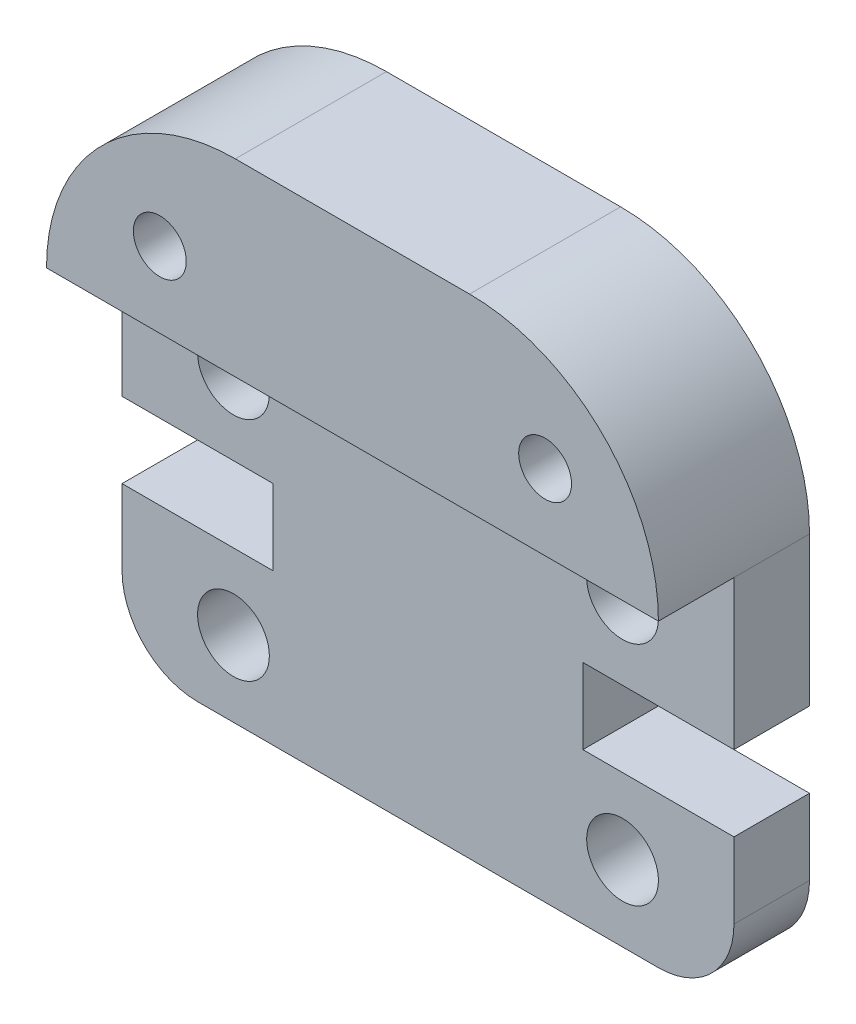
ISO-10303-21;
HEADER;
FILE_DESCRIPTION(('STEP AP214'),'2;1');
FILE_NAME('part.step','',(''),(''),'','','');
FILE_SCHEMA(('AUTOMOTIVE_DESIGN { 1 0 10303 214 1 1 1 1 }'));
ENDSEC;
DATA;
#1=APPLICATION_CONTEXT('core data for automotive mechanical design processes');
#2=APPLICATION_PROTOCOL_DEFINITION('international standard','automotive_design',2000,#1);
#3=PRODUCT_CONTEXT('',#1,'mechanical');
#4=PRODUCT('Part','Part','',(#3));
#5=PRODUCT_RELATED_PRODUCT_CATEGORY('part','',(#4));
#6=PRODUCT_DEFINITION_FORMATION('','',#4);
#7=PRODUCT_DEFINITION_CONTEXT('part definition',#1,'design');
#8=PRODUCT_DEFINITION('design','',#6,#7);
#9=PRODUCT_DEFINITION_SHAPE('','',#8);
#10=(LENGTH_UNIT() NAMED_UNIT(*) SI_UNIT(.MILLI.,.METRE.));
#11=(NAMED_UNIT(*) PLANE_ANGLE_UNIT() SI_UNIT($,.RADIAN.));
#12=(NAMED_UNIT(*) SI_UNIT($,.STERADIAN.) SOLID_ANGLE_UNIT());
#13=UNCERTAINTY_MEASURE_WITH_UNIT(LENGTH_MEASURE(1.E-05),#10,'distance_accuracy_value','');
#14=(GEOMETRIC_REPRESENTATION_CONTEXT(3) GLOBAL_UNCERTAINTY_ASSIGNED_CONTEXT((#13)) GLOBAL_UNIT_ASSIGNED_CONTEXT((#10,
#11,#12)) REPRESENTATION_CONTEXT('',''));
#15=CARTESIAN_POINT('',(0.,0.,0.));
#16=DIRECTION('',(0.,0.,1.));
#17=DIRECTION('',(1.,0.,0.));
#18=AXIS2_PLACEMENT_3D('',#15,#16,#17);
#19=CARTESIAN_POINT('',(14.2,2.,4.));
#20=DIRECTION('',(0.,0.,-1.));
#21=DIRECTION('',(-1.,0.,0.));
#22=AXIS2_PLACEMENT_3D('',#19,#20,#21);
#23=PLANE('',#22);
#24=CARTESIAN_POINT('',(3.00000000000321,11.942,4.));
#25=DIRECTION('',(0.,0.,1.));
#26=DIRECTION('',(1.,0.,0.));
#27=AXIS2_PLACEMENT_3D('',#24,#25,#26);
#28=CIRCLE('',#27,0.699999999999998);
#29=CARTESIAN_POINT('',(3.70000000000321,11.942,4.));
#30=VERTEX_POINT('',#29);
#31=EDGE_CURVE('E326',#30,#30,#28,.T.);
#32=ORIENTED_EDGE('',*,*,#31,.F.);
#33=EDGE_LOOP('',(#32));
#34=FACE_BOUND('',#33,.T.);
#35=CARTESIAN_POINT('',(13.1999999999968,11.942,4.));
#36=DIRECTION('',(0.,0.,1.));
#37=DIRECTION('',(-1.,0.,0.));
#38=AXIS2_PLACEMENT_3D('',#35,#36,#37);
#39=CIRCLE('',#38,0.699999999999999);
#40=CARTESIAN_POINT('',(12.4999999999968,11.942,4.));
#41=VERTEX_POINT('',#40);
#42=EDGE_CURVE('E332',#41,#41,#39,.T.);
#43=ORIENTED_EDGE('',*,*,#42,.F.);
#44=EDGE_LOOP('',(#43));
#45=FACE_BOUND('',#44,.T.);
#46=DIRECTION('',(1.,0.,0.));
#47=VECTOR('',#46,1.);
#48=CARTESIAN_POINT('',(16.2,9.945,4.));
#49=LINE('',#48,#47);
#50=CARTESIAN_POINT('',(0.,9.94499999999999,4.));
#51=VERTEX_POINT('',#50);
#52=CARTESIAN_POINT('',(16.2,9.945,4.));
#53=VERTEX_POINT('',#52);
#54=EDGE_CURVE('E278',#51,#53,#49,.T.);
#55=ORIENTED_EDGE('',*,*,#54,.T.);
#56=CARTESIAN_POINT('',(11.2,9.94499999999999,4.));
#57=DIRECTION('',(0.,0.,1.));
#58=DIRECTION('',(-1.,0.,0.));
#59=AXIS2_PLACEMENT_3D('',#56,#57,#58);
#60=CIRCLE('',#59,5.);
#61=CARTESIAN_POINT('',(11.2,14.945,4.));
#62=VERTEX_POINT('',#61);
#63=EDGE_CURVE('E132',#53,#62,#60,.T.);
#64=ORIENTED_EDGE('',*,*,#63,.T.);
#65=DIRECTION('',(-1.,0.,0.));
#66=VECTOR('',#65,1.);
#67=CARTESIAN_POINT('',(5.,14.945,4.));
#68=LINE('',#67,#66);
#69=CARTESIAN_POINT('',(5.,14.945,4.));
#70=VERTEX_POINT('',#69);
#71=EDGE_CURVE('E58',#62,#70,#68,.T.);
#72=ORIENTED_EDGE('',*,*,#71,.T.);
#73=CARTESIAN_POINT('',(5.,9.94499999999999,4.));
#74=DIRECTION('',(0.,0.,1.));
#75=DIRECTION('',(1.,0.,0.));
#76=AXIS2_PLACEMENT_3D('',#73,#74,#75);
#77=CIRCLE('',#76,5.);
#78=EDGE_CURVE('E123',#70,#51,#77,.T.);
#79=ORIENTED_EDGE('',*,*,#78,.T.);
#80=EDGE_LOOP('',(#55,#64,#72,#79));
#81=FACE_BOUND('',#80,.T.);
#82=ADVANCED_FACE('F33',(#34,#45,#81),#23,.F.);
#83=CARTESIAN_POINT('',(14.2,2.,4.));
#84=DIRECTION('',(0.,0.,-1.));
#85=DIRECTION('',(-1.,0.,0.));
#86=AXIS2_PLACEMENT_3D('',#83,#84,#85);
#87=CYLINDRICAL_SURFACE('',#86,2.);
#88=CARTESIAN_POINT('',(14.2,2.,2.));
#89=DIRECTION('',(0.,0.,1.));
#90=DIRECTION('',(1.,0.,0.));
#91=AXIS2_PLACEMENT_3D('',#88,#89,#90);
#92=CIRCLE('',#91,2.);
#93=CARTESIAN_POINT('',(14.2,0.,2.));
#94=VERTEX_POINT('',#93);
#95=CARTESIAN_POINT('',(16.2,2.,2.));
#96=VERTEX_POINT('',#95);
#97=EDGE_CURVE('E120',#94,#96,#92,.T.);
#98=ORIENTED_EDGE('',*,*,#97,.F.);
#99=DIRECTION('',(0.,0.,-1.));
#100=VECTOR('',#99,1.);
#101=CARTESIAN_POINT('',(14.2,0.,4.));
#102=LINE('',#101,#100);
#103=CARTESIAN_POINT('',(14.2,0.,0.));
#104=VERTEX_POINT('',#103);
#105=EDGE_CURVE('E113',#94,#104,#102,.T.);
#106=ORIENTED_EDGE('',*,*,#105,.T.);
#107=CARTESIAN_POINT('',(14.2,2.,0.));
#108=DIRECTION('',(0.,0.,1.));
#109=DIRECTION('',(-1.,0.,0.));
#110=AXIS2_PLACEMENT_3D('',#107,#108,#109);
#111=CIRCLE('',#110,2.);
#112=CARTESIAN_POINT('',(16.2,2.,0.));
#113=VERTEX_POINT('',#112);
#114=EDGE_CURVE('E117',#104,#113,#111,.T.);
#115=ORIENTED_EDGE('',*,*,#114,.T.);
#116=DIRECTION('',(0.,0.,-1.));
#117=VECTOR('',#116,1.);
#118=CARTESIAN_POINT('',(16.2,2.,4.));
#119=LINE('',#118,#117);
#120=EDGE_CURVE('E11',#96,#113,#119,.T.);
#121=ORIENTED_EDGE('',*,*,#120,.F.);
#122=EDGE_LOOP('',(#98,#106,#115,#121));
#123=FACE_BOUND('',#122,.T.);
#124=ADVANCED_FACE('F35',(#123),#87,.T.);
#125=CARTESIAN_POINT('',(16.2,2.,4.));
#126=DIRECTION('',(-1.,0.,0.));
#127=DIRECTION('',(0.,0.,1.));
#128=AXIS2_PLACEMENT_3D('',#125,#126,#127);
#129=PLANE('',#128);
#130=DIRECTION('',(0.,-1.,0.));
#131=VECTOR('',#130,1.);
#132=CARTESIAN_POINT('',(16.2,0.,2.));
#133=LINE('',#132,#131);
#134=CARTESIAN_POINT('',(16.2,4.,2.));
#135=VERTEX_POINT('',#134);
#136=EDGE_CURVE('E341',#135,#96,#133,.T.);
#137=ORIENTED_EDGE('',*,*,#136,.T.);
#138=ORIENTED_EDGE('',*,*,#120,.T.);
#139=DIRECTION('',(0.,1.,0.));
#140=VECTOR('',#139,1.);
#141=CARTESIAN_POINT('',(16.2,2.,0.));
#142=LINE('',#141,#140);
#143=CARTESIAN_POINT('',(16.2,4.,0.));
#144=VERTEX_POINT('',#143);
#145=EDGE_CURVE('E140',#113,#144,#142,.T.);
#146=ORIENTED_EDGE('',*,*,#145,.T.);
#147=DIRECTION('',(0.,0.,-1.));
#148=VECTOR('',#147,1.);
#149=CARTESIAN_POINT('',(16.2,4.,4.));
#150=LINE('',#149,#148);
#151=EDGE_CURVE('E42',#135,#144,#150,.T.);
#152=ORIENTED_EDGE('',*,*,#151,.F.);
#153=EDGE_LOOP('',(#137,#138,#146,#152));
#154=FACE_BOUND('',#153,.T.);
#155=ADVANCED_FACE('F227',(#154),#129,.F.);
#156=CARTESIAN_POINT('',(12.2,4.,4.));
#157=DIRECTION('',(0.,-1.,0.));
#158=DIRECTION('',(1.,0.,0.));
#159=AXIS2_PLACEMENT_3D('',#156,#157,#158);
#160=PLANE('',#159);
#161=DIRECTION('',(-1.,0.,0.));
#162=VECTOR('',#161,1.);
#163=CARTESIAN_POINT('',(12.2,4.,2.));
#164=LINE('',#163,#162);
#165=CARTESIAN_POINT('',(12.2,4.,2.));
#166=VERTEX_POINT('',#165);
#167=EDGE_CURVE('E224',#135,#166,#164,.T.);
#168=ORIENTED_EDGE('',*,*,#167,.F.);
#169=ORIENTED_EDGE('',*,*,#151,.T.);
#170=DIRECTION('',(-1.,0.,0.));
#171=VECTOR('',#170,1.);
#172=CARTESIAN_POINT('',(12.2,4.,0.));
#173=LINE('',#172,#171);
#174=CARTESIAN_POINT('',(12.2,4.,0.));
#175=VERTEX_POINT('',#174);
#176=EDGE_CURVE('E143',#144,#175,#173,.T.);
#177=ORIENTED_EDGE('',*,*,#176,.T.);
#178=DIRECTION('',(0.,0.,-1.));
#179=VECTOR('',#178,1.);
#180=CARTESIAN_POINT('',(12.2,4.,4.));
#181=LINE('',#180,#179);
#182=EDGE_CURVE('E214',#166,#175,#181,.T.);
#183=ORIENTED_EDGE('',*,*,#182,.F.);
#184=EDGE_LOOP('',(#168,#169,#177,#183));
#185=FACE_BOUND('',#184,.T.);
#186=ADVANCED_FACE('F219',(#185),#160,.F.);
#187=CARTESIAN_POINT('',(12.2,6.,4.));
#188=DIRECTION('',(-1.,0.,0.));
#189=DIRECTION('',(0.,0.,1.));
#190=AXIS2_PLACEMENT_3D('',#187,#188,#189);
#191=PLANE('',#190);
#192=DIRECTION('',(0.,1.,0.));
#193=VECTOR('',#192,1.);
#194=CARTESIAN_POINT('',(12.2,6.,2.));
#195=LINE('',#194,#193);
#196=CARTESIAN_POINT('',(12.2,6.,2.));
#197=VERTEX_POINT('',#196);
#198=EDGE_CURVE('E236',#166,#197,#195,.T.);
#199=ORIENTED_EDGE('',*,*,#198,.F.);
#200=ORIENTED_EDGE('',*,*,#182,.T.);
#201=DIRECTION('',(0.,1.,0.));
#202=VECTOR('',#201,1.);
#203=CARTESIAN_POINT('',(12.2,6.,0.));
#204=LINE('',#203,#202);
#205=CARTESIAN_POINT('',(12.2,6.,0.));
#206=VERTEX_POINT('',#205);
#207=EDGE_CURVE('E153',#175,#206,#204,.T.);
#208=ORIENTED_EDGE('',*,*,#207,.T.);
#209=DIRECTION('',(0.,0.,-1.));
#210=VECTOR('',#209,1.);
#211=CARTESIAN_POINT('',(12.2,6.,4.));
#212=LINE('',#211,#210);
#213=EDGE_CURVE('E212',#197,#206,#212,.T.);
#214=ORIENTED_EDGE('',*,*,#213,.F.);
#215=EDGE_LOOP('',(#199,#200,#208,#214));
#216=FACE_BOUND('',#215,.T.);
#217=ADVANCED_FACE('F233',(#216),#191,.F.);
#218=CARTESIAN_POINT('',(16.2,6.00000000000001,4.));
#219=DIRECTION('',(0.,1.,0.));
#220=DIRECTION('',(-1.,0.,0.));
#221=AXIS2_PLACEMENT_3D('',#218,#219,#220);
#222=PLANE('',#221);
#223=DIRECTION('',(1.,0.,0.));
#224=VECTOR('',#223,1.);
#225=CARTESIAN_POINT('',(16.2,6.00000000000001,2.));
#226=LINE('',#225,#224);
#227=CARTESIAN_POINT('',(16.2,6.00000000000001,2.));
#228=VERTEX_POINT('',#227);
#229=EDGE_CURVE('E308',#197,#228,#226,.T.);
#230=ORIENTED_EDGE('',*,*,#229,.F.);
#231=ORIENTED_EDGE('',*,*,#213,.T.);
#232=DIRECTION('',(1.,0.,0.));
#233=VECTOR('',#232,1.);
#234=CARTESIAN_POINT('',(16.2,6.00000000000001,0.));
#235=LINE('',#234,#233);
#236=CARTESIAN_POINT('',(16.2,6.00000000000001,0.));
#237=VERTEX_POINT('',#236);
#238=EDGE_CURVE('E156',#206,#237,#235,.T.);
#239=ORIENTED_EDGE('',*,*,#238,.T.);
#240=DIRECTION('',(0.,0.,-1.));
#241=VECTOR('',#240,1.);
#242=CARTESIAN_POINT('',(16.2,6.00000000000001,4.));
#243=LINE('',#242,#241);
#244=EDGE_CURVE('E210',#228,#237,#243,.T.);
#245=ORIENTED_EDGE('',*,*,#244,.F.);
#246=EDGE_LOOP('',(#230,#231,#239,#245));
#247=FACE_BOUND('',#246,.T.);
#248=ADVANCED_FACE('F353',(#247),#222,.F.);
#249=CARTESIAN_POINT('',(16.2,9.945,4.));
#250=DIRECTION('',(-1.,0.,0.));
#251=DIRECTION('',(0.,-1.,0.));
#252=AXIS2_PLACEMENT_3D('',#249,#250,#251);
#253=PLANE('',#252);
#254=CARTESIAN_POINT('',(16.2,9.945,2.));
#255=VERTEX_POINT('',#254);
#256=EDGE_CURVE('E287',#255,#228,#133,.T.);
#257=ORIENTED_EDGE('',*,*,#256,.T.);
#258=ORIENTED_EDGE('',*,*,#244,.T.);
#259=DIRECTION('',(0.,1.,0.));
#260=VECTOR('',#259,1.);
#261=CARTESIAN_POINT('',(16.2,9.945,0.));
#262=LINE('',#261,#260);
#263=CARTESIAN_POINT('',(16.2,9.945,0.));
#264=VERTEX_POINT('',#263);
#265=EDGE_CURVE('E159',#237,#264,#262,.T.);
#266=ORIENTED_EDGE('',*,*,#265,.T.);
#267=DIRECTION('',(0.,0.,-1.));
#268=VECTOR('',#267,1.);
#269=CARTESIAN_POINT('',(16.2,9.945,4.));
#270=LINE('',#269,#268);
#271=EDGE_CURVE('E206',#255,#264,#270,.T.);
#272=ORIENTED_EDGE('',*,*,#271,.F.);
#273=EDGE_LOOP('',(#257,#258,#266,#272));
#274=FACE_BOUND('',#273,.T.);
#275=ADVANCED_FACE('F349',(#274),#253,.F.);
#276=CARTESIAN_POINT('',(0.,9.94499999999999,4.));
#277=DIRECTION('',(1.,0.,0.));
#278=DIRECTION('',(0.,0.,-1.));
#279=AXIS2_PLACEMENT_3D('',#276,#277,#278);
#280=PLANE('',#279);
#281=DIRECTION('',(0.,1.,0.));
#282=VECTOR('',#281,1.);
#283=CARTESIAN_POINT('',(0.,9.94499999999999,2.));
#284=LINE('',#283,#282);
#285=CARTESIAN_POINT('',(0.,6.00000000000001,2.));
#286=VERTEX_POINT('',#285);
#287=CARTESIAN_POINT('',(0.,9.94499999999999,2.));
#288=VERTEX_POINT('',#287);
#289=EDGE_CURVE('E284',#286,#288,#284,.T.);
#290=ORIENTED_EDGE('',*,*,#289,.T.);
#291=DIRECTION('',(0.,0.,-1.));
#292=VECTOR('',#291,1.);
#293=CARTESIAN_POINT('',(0.,9.94499999999999,4.));
#294=LINE('',#293,#292);
#295=CARTESIAN_POINT('',(0.,9.94499999999999,0.));
#296=VERTEX_POINT('',#295);
#297=EDGE_CURVE('E196',#288,#296,#294,.T.);
#298=ORIENTED_EDGE('',*,*,#297,.T.);
#299=DIRECTION('',(0.,-1.,0.));
#300=VECTOR('',#299,1.);
#301=CARTESIAN_POINT('',(0.,9.94499999999999,0.));
#302=LINE('',#301,#300);
#303=CARTESIAN_POINT('',(0.,6.00000000000001,0.));
#304=VERTEX_POINT('',#303);
#305=EDGE_CURVE('E169',#296,#304,#302,.T.);
#306=ORIENTED_EDGE('',*,*,#305,.T.);
#307=DIRECTION('',(0.,0.,-1.));
#308=VECTOR('',#307,1.);
#309=CARTESIAN_POINT('',(0.,6.00000000000001,4.));
#310=LINE('',#309,#308);
#311=EDGE_CURVE('E194',#286,#304,#310,.T.);
#312=ORIENTED_EDGE('',*,*,#311,.F.);
#313=EDGE_LOOP('',(#290,#298,#306,#312));
#314=FACE_BOUND('',#313,.T.);
#315=ADVANCED_FACE('F293',(#314),#280,.F.);
#316=CARTESIAN_POINT('',(0.,6.00000000000001,4.));
#317=DIRECTION('',(0.,1.,0.));
#318=DIRECTION('',(0.,0.,1.));
#319=AXIS2_PLACEMENT_3D('',#316,#317,#318);
#320=PLANE('',#319);
#321=DIRECTION('',(1.,0.,0.));
#322=VECTOR('',#321,1.);
#323=CARTESIAN_POINT('',(0.,6.00000000000001,2.));
#324=LINE('',#323,#322);
#325=CARTESIAN_POINT('',(4.,6.00000000000001,2.));
#326=VERTEX_POINT('',#325);
#327=EDGE_CURVE('E306',#286,#326,#324,.T.);
#328=ORIENTED_EDGE('',*,*,#327,.F.);
#329=ORIENTED_EDGE('',*,*,#311,.T.);
#330=DIRECTION('',(1.,0.,0.));
#331=VECTOR('',#330,1.);
#332=CARTESIAN_POINT('',(0.,6.00000000000001,0.));
#333=LINE('',#332,#331);
#334=CARTESIAN_POINT('',(4.,6.00000000000001,0.));
#335=VERTEX_POINT('',#334);
#336=EDGE_CURVE('E172',#304,#335,#333,.T.);
#337=ORIENTED_EDGE('',*,*,#336,.T.);
#338=DIRECTION('',(0.,0.,-1.));
#339=VECTOR('',#338,1.);
#340=CARTESIAN_POINT('',(4.,6.00000000000001,4.));
#341=LINE('',#340,#339);
#342=EDGE_CURVE('E192',#326,#335,#341,.T.);
#343=ORIENTED_EDGE('',*,*,#342,.F.);
#344=EDGE_LOOP('',(#328,#329,#337,#343));
#345=FACE_BOUND('',#344,.T.);
#346=ADVANCED_FACE('F305',(#345),#320,.F.);
#347=CARTESIAN_POINT('',(4.,6.00000000000001,4.));
#348=DIRECTION('',(1.,0.,0.));
#349=DIRECTION('',(0.,0.,-1.));
#350=AXIS2_PLACEMENT_3D('',#347,#348,#349);
#351=PLANE('',#350);
#352=DIRECTION('',(0.,-1.,0.));
#353=VECTOR('',#352,1.);
#354=CARTESIAN_POINT('',(4.,6.00000000000001,2.));
#355=LINE('',#354,#353);
#356=CARTESIAN_POINT('',(4.,4.,2.));
#357=VERTEX_POINT('',#356);
#358=EDGE_CURVE('E309',#326,#357,#355,.T.);
#359=ORIENTED_EDGE('',*,*,#358,.F.);
#360=ORIENTED_EDGE('',*,*,#342,.T.);
#361=DIRECTION('',(0.,-1.,0.));
#362=VECTOR('',#361,1.);
#363=CARTESIAN_POINT('',(4.,6.00000000000001,0.));
#364=LINE('',#363,#362);
#365=CARTESIAN_POINT('',(4.,4.,0.));
#366=VERTEX_POINT('',#365);
#367=EDGE_CURVE('E175',#335,#366,#364,.T.);
#368=ORIENTED_EDGE('',*,*,#367,.T.);
#369=DIRECTION('',(0.,0.,-1.));
#370=VECTOR('',#369,1.);
#371=CARTESIAN_POINT('',(4.,4.,4.));
#372=LINE('',#371,#370);
#373=EDGE_CURVE('E190',#357,#366,#372,.T.);
#374=ORIENTED_EDGE('',*,*,#373,.F.);
#375=EDGE_LOOP('',(#359,#360,#368,#374));
#376=FACE_BOUND('',#375,.T.);
#377=ADVANCED_FACE('F391',(#376),#351,.F.);
#378=CARTESIAN_POINT('',(4.,4.,4.));
#379=DIRECTION('',(0.,-1.,0.));
#380=DIRECTION('',(0.,0.,-1.));
#381=AXIS2_PLACEMENT_3D('',#378,#379,#380);
#382=PLANE('',#381);
#383=DIRECTION('',(-1.,0.,0.));
#384=VECTOR('',#383,1.);
#385=CARTESIAN_POINT('',(4.,4.,2.));
#386=LINE('',#385,#384);
#387=CARTESIAN_POINT('',(0.,4.,2.));
#388=VERTEX_POINT('',#387);
#389=EDGE_CURVE('E312',#357,#388,#386,.T.);
#390=ORIENTED_EDGE('',*,*,#389,.F.);
#391=ORIENTED_EDGE('',*,*,#373,.T.);
#392=DIRECTION('',(-1.,0.,0.));
#393=VECTOR('',#392,1.);
#394=CARTESIAN_POINT('',(4.,4.,0.));
#395=LINE('',#394,#393);
#396=CARTESIAN_POINT('',(0.,4.,0.));
#397=VERTEX_POINT('',#396);
#398=EDGE_CURVE('E178',#366,#397,#395,.T.);
#399=ORIENTED_EDGE('',*,*,#398,.T.);
#400=DIRECTION('',(0.,0.,-1.));
#401=VECTOR('',#400,1.);
#402=CARTESIAN_POINT('',(0.,4.,4.));
#403=LINE('',#402,#401);
#404=EDGE_CURVE('E188',#388,#397,#403,.T.);
#405=ORIENTED_EDGE('',*,*,#404,.F.);
#406=EDGE_LOOP('',(#390,#391,#399,#405));
#407=FACE_BOUND('',#406,.T.);
#408=ADVANCED_FACE('F387',(#407),#382,.F.);
#409=CARTESIAN_POINT('',(0.,2.,4.));
#410=DIRECTION('',(1.,0.,0.));
#411=DIRECTION('',(0.,0.,-1.));
#412=AXIS2_PLACEMENT_3D('',#409,#410,#411);
#413=PLANE('',#412);
#414=CARTESIAN_POINT('',(0.,2.,2.));
#415=VERTEX_POINT('',#414);
#416=EDGE_CURVE('E289',#415,#388,#284,.T.);
#417=ORIENTED_EDGE('',*,*,#416,.T.);
#418=ORIENTED_EDGE('',*,*,#404,.T.);
#419=DIRECTION('',(0.,-1.,0.));
#420=VECTOR('',#419,1.);
#421=CARTESIAN_POINT('',(0.,2.,0.));
#422=LINE('',#421,#420);
#423=CARTESIAN_POINT('',(0.,2.,0.));
#424=VERTEX_POINT('',#423);
#425=EDGE_CURVE('E181',#397,#424,#422,.T.);
#426=ORIENTED_EDGE('',*,*,#425,.T.);
#427=DIRECTION('',(0.,0.,-1.));
#428=VECTOR('',#427,1.);
#429=CARTESIAN_POINT('',(0.,2.,4.));
#430=LINE('',#429,#428);
#431=EDGE_CURVE('E186',#415,#424,#430,.T.);
#432=ORIENTED_EDGE('',*,*,#431,.F.);
#433=EDGE_LOOP('',(#417,#418,#426,#432));
#434=FACE_BOUND('',#433,.T.);
#435=ADVANCED_FACE('F383',(#434),#413,.F.);
#436=CARTESIAN_POINT('',(2.,2.,4.));
#437=DIRECTION('',(0.,0.,-1.));
#438=DIRECTION('',(-1.,0.,0.));
#439=AXIS2_PLACEMENT_3D('',#436,#437,#438);
#440=CYLINDRICAL_SURFACE('',#439,2.);
#441=CARTESIAN_POINT('',(2.,2.,2.));
#442=DIRECTION('',(0.,0.,1.));
#443=DIRECTION('',(1.,0.,0.));
#444=AXIS2_PLACEMENT_3D('',#441,#442,#443);
#445=CIRCLE('',#444,2.);
#446=CARTESIAN_POINT('',(2.,0.,2.));
#447=VERTEX_POINT('',#446);
#448=EDGE_CURVE('E49',#415,#447,#445,.T.);
#449=ORIENTED_EDGE('',*,*,#448,.F.);
#450=ORIENTED_EDGE('',*,*,#431,.T.);
#451=CARTESIAN_POINT('',(2.,2.,0.));
#452=DIRECTION('',(0.,0.,1.));
#453=DIRECTION('',(1.,0.,0.));
#454=AXIS2_PLACEMENT_3D('',#451,#452,#453);
#455=CIRCLE('',#454,2.);
#456=CARTESIAN_POINT('',(2.,0.,0.));
#457=VERTEX_POINT('',#456);
#458=EDGE_CURVE('E133',#424,#457,#455,.T.);
#459=ORIENTED_EDGE('',*,*,#458,.T.);
#460=DIRECTION('',(0.,0.,-1.));
#461=VECTOR('',#460,1.);
#462=CARTESIAN_POINT('',(2.,0.,4.));
#463=LINE('',#462,#461);
#464=EDGE_CURVE('E122',#447,#457,#463,.T.);
#465=ORIENTED_EDGE('',*,*,#464,.F.);
#466=EDGE_LOOP('',(#449,#450,#459,#465));
#467=FACE_BOUND('',#466,.T.);
#468=ADVANCED_FACE('F380',(#467),#440,.T.);
#469=CARTESIAN_POINT('',(2.,0.,4.));
#470=DIRECTION('',(0.,1.,0.));
#471=DIRECTION('',(-1.,0.,0.));
#472=AXIS2_PLACEMENT_3D('',#469,#470,#471);
#473=PLANE('',#472);
#474=DIRECTION('',(-1.,0.,0.));
#475=VECTOR('',#474,1.);
#476=CARTESIAN_POINT('',(0.,0.,2.));
#477=LINE('',#476,#475);
#478=EDGE_CURVE('E294',#94,#447,#477,.T.);
#479=ORIENTED_EDGE('',*,*,#478,.T.);
#480=ORIENTED_EDGE('',*,*,#464,.T.);
#481=DIRECTION('',(1.,0.,0.));
#482=VECTOR('',#481,1.);
#483=CARTESIAN_POINT('',(2.,0.,0.));
#484=LINE('',#483,#482);
#485=EDGE_CURVE('E126',#457,#104,#484,.T.);
#486=ORIENTED_EDGE('',*,*,#485,.T.);
#487=ORIENTED_EDGE('',*,*,#105,.F.);
#488=EDGE_LOOP('',(#479,#480,#486,#487));
#489=FACE_BOUND('',#488,.T.);
#490=ADVANCED_FACE('F127',(#489),#473,.F.);
#491=CARTESIAN_POINT('',(13.25,8.,4.));
#492=DIRECTION('',(0.,0.,-1.));
#493=DIRECTION('',(-1.,0.,0.));
#494=AXIS2_PLACEMENT_3D('',#491,#492,#493);
#495=CYLINDRICAL_SURFACE('',#494,0.949999999999999);
#496=CARTESIAN_POINT('',(13.25,8.,0.));
#497=DIRECTION('',(0.,0.,1.));
#498=DIRECTION('',(1.,0.,0.));
#499=AXIS2_PLACEMENT_3D('',#496,#497,#498);
#500=CIRCLE('',#499,0.949999999999999);
#501=CARTESIAN_POINT('',(14.2,8.,0.));
#502=VERTEX_POINT('',#501);
#503=EDGE_CURVE('E141',#502,#502,#500,.T.);
#504=ORIENTED_EDGE('',*,*,#503,.F.);
#505=EDGE_LOOP('',(#504));
#506=FACE_BOUND('',#505,.T.);
#507=CARTESIAN_POINT('',(13.25,8.,2.));
#508=DIRECTION('',(0.,0.,1.));
#509=DIRECTION('',(1.,0.,0.));
#510=AXIS2_PLACEMENT_3D('',#507,#508,#509);
#511=CIRCLE('',#510,0.949999999999999);
#512=CARTESIAN_POINT('',(14.2,8.,2.));
#513=VERTEX_POINT('',#512);
#514=EDGE_CURVE('E593',#513,#513,#511,.T.);
#515=ORIENTED_EDGE('',*,*,#514,.T.);
#516=EDGE_LOOP('',(#515));
#517=FACE_BOUND('',#516,.T.);
#518=ADVANCED_FACE('F372',(#506,#517),#495,.F.);
#519=CARTESIAN_POINT('',(13.25,2.,4.));
#520=DIRECTION('',(0.,0.,-1.));
#521=DIRECTION('',(-1.,0.,0.));
#522=AXIS2_PLACEMENT_3D('',#519,#520,#521);
#523=CYLINDRICAL_SURFACE('',#522,0.949999999999999);
#524=CARTESIAN_POINT('',(13.25,2.,0.));
#525=DIRECTION('',(0.,0.,1.));
#526=DIRECTION('',(-1.,0.,0.));
#527=AXIS2_PLACEMENT_3D('',#524,#525,#526);
#528=CIRCLE('',#527,0.949999999999999);
#529=CARTESIAN_POINT('',(12.3,2.,0.));
#530=VERTEX_POINT('',#529);
#531=EDGE_CURVE('E146',#530,#530,#528,.T.);
#532=ORIENTED_EDGE('',*,*,#531,.F.);
#533=EDGE_LOOP('',(#532));
#534=FACE_BOUND('',#533,.T.);
#535=CARTESIAN_POINT('',(13.25,2.,2.));
#536=DIRECTION('',(0.,0.,1.));
#537=DIRECTION('',(1.,0.,0.));
#538=AXIS2_PLACEMENT_3D('',#535,#536,#537);
#539=CIRCLE('',#538,0.949999999999999);
#540=CARTESIAN_POINT('',(14.2,2.,2.));
#541=VERTEX_POINT('',#540);
#542=EDGE_CURVE('E588',#541,#541,#539,.T.);
#543=ORIENTED_EDGE('',*,*,#542,.T.);
#544=EDGE_LOOP('',(#543));
#545=FACE_BOUND('',#544,.T.);
#546=ADVANCED_FACE('F531',(#534,#545),#523,.F.);
#547=CARTESIAN_POINT('',(2.95,2.,4.));
#548=DIRECTION('',(0.,0.,-1.));
#549=DIRECTION('',(-1.,0.,0.));
#550=AXIS2_PLACEMENT_3D('',#547,#548,#549);
#551=CYLINDRICAL_SURFACE('',#550,0.95);
#552=CARTESIAN_POINT('',(2.95,2.,0.));
#553=DIRECTION('',(0.,0.,1.));
#554=DIRECTION('',(1.,0.,0.));
#555=AXIS2_PLACEMENT_3D('',#552,#553,#554);
#556=CIRCLE('',#555,0.95);
#557=CARTESIAN_POINT('',(3.9,2.,0.));
#558=VERTEX_POINT('',#557);
#559=EDGE_CURVE('E322',#558,#558,#556,.T.);
#560=ORIENTED_EDGE('',*,*,#559,.F.);
#561=EDGE_LOOP('',(#560));
#562=FACE_BOUND('',#561,.T.);
#563=CARTESIAN_POINT('',(2.95,2.,2.));
#564=DIRECTION('',(0.,0.,1.));
#565=DIRECTION('',(1.,0.,0.));
#566=AXIS2_PLACEMENT_3D('',#563,#564,#565);
#567=CIRCLE('',#566,0.95);
#568=CARTESIAN_POINT('',(3.9,2.,2.));
#569=VERTEX_POINT('',#568);
#570=EDGE_CURVE('E586',#569,#569,#567,.T.);
#571=ORIENTED_EDGE('',*,*,#570,.T.);
#572=EDGE_LOOP('',(#571));
#573=FACE_BOUND('',#572,.T.);
#574=ADVANCED_FACE('F539',(#562,#573),#551,.F.);
#575=CARTESIAN_POINT('',(2.95,8.,4.));
#576=DIRECTION('',(0.,0.,-1.));
#577=DIRECTION('',(-1.,0.,0.));
#578=AXIS2_PLACEMENT_3D('',#575,#576,#577);
#579=CYLINDRICAL_SURFACE('',#578,0.95);
#580=CARTESIAN_POINT('',(2.95,8.,0.));
#581=DIRECTION('',(0.,0.,1.));
#582=DIRECTION('',(-1.,0.,0.));
#583=AXIS2_PLACEMENT_3D('',#580,#581,#582);
#584=CIRCLE('',#583,0.95);
#585=CARTESIAN_POINT('',(2.,8.,0.));
#586=VERTEX_POINT('',#585);
#587=EDGE_CURVE('E319',#586,#586,#584,.T.);
#588=ORIENTED_EDGE('',*,*,#587,.F.);
#589=EDGE_LOOP('',(#588));
#590=FACE_BOUND('',#589,.T.);
#591=CARTESIAN_POINT('',(2.95,8.,2.));
#592=DIRECTION('',(0.,0.,1.));
#593=DIRECTION('',(1.,0.,0.));
#594=AXIS2_PLACEMENT_3D('',#591,#592,#593);
#595=CIRCLE('',#594,0.95);
#596=CARTESIAN_POINT('',(3.9,8.,2.));
#597=VERTEX_POINT('',#596);
#598=EDGE_CURVE('E37',#597,#597,#595,.T.);
#599=ORIENTED_EDGE('',*,*,#598,.T.);
#600=EDGE_LOOP('',(#599));
#601=FACE_BOUND('',#600,.T.);
#602=ADVANCED_FACE('F376',(#590,#601),#579,.F.);
#603=CARTESIAN_POINT('',(14.2,2.,0.));
#604=DIRECTION('',(0.,0.,-1.));
#605=DIRECTION('',(-1.,0.,0.));
#606=AXIS2_PLACEMENT_3D('',#603,#604,#605);
#607=PLANE('',#606);
#608=ORIENTED_EDGE('',*,*,#559,.T.);
#609=EDGE_LOOP('',(#608));
#610=FACE_BOUND('',#609,.T.);
#611=CARTESIAN_POINT('',(13.1999999999968,11.942,0.));
#612=DIRECTION('',(0.,0.,1.));
#613=DIRECTION('',(-1.,0.,0.));
#614=AXIS2_PLACEMENT_3D('',#611,#612,#613);
#615=CIRCLE('',#614,0.699999999999999);
#616=CARTESIAN_POINT('',(12.4999999999968,11.942,0.));
#617=VERTEX_POINT('',#616);
#618=EDGE_CURVE('E329',#617,#617,#615,.T.);
#619=ORIENTED_EDGE('',*,*,#618,.T.);
#620=EDGE_LOOP('',(#619));
#621=FACE_BOUND('',#620,.T.);
#622=ORIENTED_EDGE('',*,*,#503,.T.);
#623=EDGE_LOOP('',(#622));
#624=FACE_BOUND('',#623,.T.);
#625=ORIENTED_EDGE('',*,*,#114,.F.);
#626=ORIENTED_EDGE('',*,*,#485,.F.);
#627=ORIENTED_EDGE('',*,*,#458,.F.);
#628=ORIENTED_EDGE('',*,*,#425,.F.);
#629=ORIENTED_EDGE('',*,*,#398,.F.);
#630=ORIENTED_EDGE('',*,*,#367,.F.);
#631=ORIENTED_EDGE('',*,*,#336,.F.);
#632=ORIENTED_EDGE('',*,*,#305,.F.);
#633=CARTESIAN_POINT('',(5.,9.94499999999999,0.));
#634=DIRECTION('',(0.,0.,1.));
#635=DIRECTION('',(1.,0.,0.));
#636=AXIS2_PLACEMENT_3D('',#633,#634,#635);
#637=CIRCLE('',#636,5.);
#638=CARTESIAN_POINT('',(5.,14.945,0.));
#639=VERTEX_POINT('',#638);
#640=EDGE_CURVE('E166',#639,#296,#637,.T.);
#641=ORIENTED_EDGE('',*,*,#640,.F.);
#642=DIRECTION('',(-1.,0.,0.));
#643=VECTOR('',#642,1.);
#644=CARTESIAN_POINT('',(5.,14.945,0.));
#645=LINE('',#644,#643);
#646=CARTESIAN_POINT('',(11.2,14.945,0.));
#647=VERTEX_POINT('',#646);
#648=EDGE_CURVE('E164',#647,#639,#645,.T.);
#649=ORIENTED_EDGE('',*,*,#648,.F.);
#650=CARTESIAN_POINT('',(11.2,9.94499999999999,0.));
#651=DIRECTION('',(0.,0.,1.));
#652=DIRECTION('',(-1.,0.,0.));
#653=AXIS2_PLACEMENT_3D('',#650,#651,#652);
#654=CIRCLE('',#653,5.);
#655=EDGE_CURVE('E162',#264,#647,#654,.T.);
#656=ORIENTED_EDGE('',*,*,#655,.F.);
#657=ORIENTED_EDGE('',*,*,#265,.F.);
#658=ORIENTED_EDGE('',*,*,#238,.F.);
#659=ORIENTED_EDGE('',*,*,#207,.F.);
#660=ORIENTED_EDGE('',*,*,#176,.F.);
#661=ORIENTED_EDGE('',*,*,#145,.F.);
#662=EDGE_LOOP('',(#625,#626,#627,#628,#629,#630,#631,#632,#641,#649,#656,#657,#658,#659,#660,#661));
#663=FACE_BOUND('',#662,.T.);
#664=ORIENTED_EDGE('',*,*,#531,.T.);
#665=EDGE_LOOP('',(#664));
#666=FACE_BOUND('',#665,.T.);
#667=CARTESIAN_POINT('',(3.00000000000321,11.942,0.));
#668=DIRECTION('',(0.,0.,1.));
#669=DIRECTION('',(1.,0.,0.));
#670=AXIS2_PLACEMENT_3D('',#667,#668,#669);
#671=CIRCLE('',#670,0.699999999999998);
#672=CARTESIAN_POINT('',(3.70000000000321,11.942,0.));
#673=VERTEX_POINT('',#672);
#674=EDGE_CURVE('E325',#673,#673,#671,.T.);
#675=ORIENTED_EDGE('',*,*,#674,.T.);
#676=EDGE_LOOP('',(#675));
#677=FACE_BOUND('',#676,.T.);
#678=ORIENTED_EDGE('',*,*,#587,.T.);
#679=EDGE_LOOP('',(#678));
#680=FACE_BOUND('',#679,.T.);
#681=ADVANCED_FACE('F136',(#610,#621,#624,#663,#666,#677,#680),#607,.T.);
#682=CARTESIAN_POINT('',(11.2,9.94499999999999,4.));
#683=DIRECTION('',(0.,0.,-1.));
#684=DIRECTION('',(-1.,0.,0.));
#685=AXIS2_PLACEMENT_3D('',#682,#683,#684);
#686=CYLINDRICAL_SURFACE('',#685,5.);
#687=ORIENTED_EDGE('',*,*,#655,.T.);
#688=DIRECTION('',(0.,0.,-1.));
#689=VECTOR('',#688,1.);
#690=CARTESIAN_POINT('',(11.2,14.945,4.));
#691=LINE('',#690,#689);
#692=EDGE_CURVE('E203',#62,#647,#691,.T.);
#693=ORIENTED_EDGE('',*,*,#692,.F.);
#694=ORIENTED_EDGE('',*,*,#63,.F.);
#695=EDGE_CURVE('E207',#53,#255,#270,.T.);
#696=ORIENTED_EDGE('',*,*,#695,.T.);
#697=ORIENTED_EDGE('',*,*,#271,.T.);
#698=EDGE_LOOP('',(#687,#693,#694,#696,#697));
#699=FACE_BOUND('',#698,.T.);
#700=ADVANCED_FACE('F344',(#699),#686,.T.);
#701=CARTESIAN_POINT('',(5.,14.945,4.));
#702=DIRECTION('',(0.,-1.,0.));
#703=DIRECTION('',(0.,0.,-1.));
#704=AXIS2_PLACEMENT_3D('',#701,#702,#703);
#705=PLANE('',#704);
#706=ORIENTED_EDGE('',*,*,#648,.T.);
#707=DIRECTION('',(0.,0.,-1.));
#708=VECTOR('',#707,1.);
#709=CARTESIAN_POINT('',(5.,14.945,4.));
#710=LINE('',#709,#708);
#711=EDGE_CURVE('E200',#70,#639,#710,.T.);
#712=ORIENTED_EDGE('',*,*,#711,.F.);
#713=ORIENTED_EDGE('',*,*,#71,.F.);
#714=ORIENTED_EDGE('',*,*,#692,.T.);
#715=EDGE_LOOP('',(#706,#712,#713,#714));
#716=FACE_BOUND('',#715,.T.);
#717=ADVANCED_FACE('F347',(#716),#705,.F.);
#718=CARTESIAN_POINT('',(5.,9.94499999999999,4.));
#719=DIRECTION('',(0.,0.,-1.));
#720=DIRECTION('',(-1.,0.,0.));
#721=AXIS2_PLACEMENT_3D('',#718,#719,#720);
#722=CYLINDRICAL_SURFACE('',#721,5.);
#723=ORIENTED_EDGE('',*,*,#640,.T.);
#724=ORIENTED_EDGE('',*,*,#297,.F.);
#725=EDGE_CURVE('E197',#51,#288,#294,.T.);
#726=ORIENTED_EDGE('',*,*,#725,.F.);
#727=ORIENTED_EDGE('',*,*,#78,.F.);
#728=ORIENTED_EDGE('',*,*,#711,.T.);
#729=EDGE_LOOP('',(#723,#724,#726,#727,#728));
#730=FACE_BOUND('',#729,.T.);
#731=ADVANCED_FACE('F296',(#730),#722,.T.);
#732=CARTESIAN_POINT('',(13.1999999999968,11.942,4.));
#733=DIRECTION('',(0.,0.,-1.));
#734=DIRECTION('',(-1.,0.,0.));
#735=AXIS2_PLACEMENT_3D('',#732,#733,#734);
#736=CYLINDRICAL_SURFACE('',#735,0.699999999999999);
#737=ORIENTED_EDGE('',*,*,#42,.T.);
#738=EDGE_LOOP('',(#737));
#739=FACE_BOUND('',#738,.T.);
#740=ORIENTED_EDGE('',*,*,#618,.F.);
#741=EDGE_LOOP('',(#740));
#742=FACE_BOUND('',#741,.T.);
#743=ADVANCED_FACE('F402',(#739,#742),#736,.F.);
#744=CARTESIAN_POINT('',(3.00000000000321,11.942,4.));
#745=DIRECTION('',(0.,0.,-1.));
#746=DIRECTION('',(-1.,0.,0.));
#747=AXIS2_PLACEMENT_3D('',#744,#745,#746);
#748=CYLINDRICAL_SURFACE('',#747,0.699999999999998);
#749=ORIENTED_EDGE('',*,*,#31,.T.);
#750=EDGE_LOOP('',(#749));
#751=FACE_BOUND('',#750,.T.);
#752=ORIENTED_EDGE('',*,*,#674,.F.);
#753=EDGE_LOOP('',(#752));
#754=FACE_BOUND('',#753,.T.);
#755=ADVANCED_FACE('F427',(#751,#754),#748,.F.);
#756=CARTESIAN_POINT('',(0.,0.,2.));
#757=DIRECTION('',(0.,0.,1.));
#758=DIRECTION('',(1.,0.,0.));
#759=AXIS2_PLACEMENT_3D('',#756,#757,#758);
#760=PLANE('',#759);
#761=ORIENTED_EDGE('',*,*,#514,.F.);
#762=EDGE_LOOP('',(#761));
#763=FACE_BOUND('',#762,.T.);
#764=ORIENTED_EDGE('',*,*,#542,.F.);
#765=EDGE_LOOP('',(#764));
#766=FACE_BOUND('',#765,.T.);
#767=ORIENTED_EDGE('',*,*,#570,.F.);
#768=EDGE_LOOP('',(#767));
#769=FACE_BOUND('',#768,.T.);
#770=ORIENTED_EDGE('',*,*,#598,.F.);
#771=EDGE_LOOP('',(#770));
#772=FACE_BOUND('',#771,.T.);
#773=ORIENTED_EDGE('',*,*,#97,.T.);
#774=ORIENTED_EDGE('',*,*,#136,.F.);
#775=ORIENTED_EDGE('',*,*,#167,.T.);
#776=ORIENTED_EDGE('',*,*,#198,.T.);
#777=ORIENTED_EDGE('',*,*,#229,.T.);
#778=ORIENTED_EDGE('',*,*,#256,.F.);
#779=DIRECTION('',(1.,0.,0.));
#780=VECTOR('',#779,1.);
#781=CARTESIAN_POINT('',(16.2,9.945,2.));
#782=LINE('',#781,#780);
#783=EDGE_CURVE('E275',#288,#255,#782,.T.);
#784=ORIENTED_EDGE('',*,*,#783,.F.);
#785=ORIENTED_EDGE('',*,*,#289,.F.);
#786=ORIENTED_EDGE('',*,*,#327,.T.);
#787=ORIENTED_EDGE('',*,*,#358,.T.);
#788=ORIENTED_EDGE('',*,*,#389,.T.);
#789=ORIENTED_EDGE('',*,*,#416,.F.);
#790=ORIENTED_EDGE('',*,*,#448,.T.);
#791=ORIENTED_EDGE('',*,*,#478,.F.);
#792=EDGE_LOOP('',(#773,#774,#775,#776,#777,#778,#784,#785,#786,#787,#788,#789,#790,#791));
#793=FACE_BOUND('',#792,.T.);
#794=ADVANCED_FACE('F283',(#763,#766,#769,#772,#793),#760,.T.);
#795=CARTESIAN_POINT('',(16.2,9.945,2.));
#796=DIRECTION('',(0.,-1.,0.));
#797=DIRECTION('',(1.,0.,0.));
#798=AXIS2_PLACEMENT_3D('',#795,#796,#797);
#799=PLANE('',#798);
#800=ORIENTED_EDGE('',*,*,#54,.F.);
#801=ORIENTED_EDGE('',*,*,#725,.T.);
#802=ORIENTED_EDGE('',*,*,#783,.T.);
#803=ORIENTED_EDGE('',*,*,#695,.F.);
#804=EDGE_LOOP('',(#800,#801,#802,#803));
#805=FACE_BOUND('',#804,.T.);
#806=ADVANCED_FACE('F274',(#805),#799,.T.);
#807=CLOSED_SHELL('',(#82,#124,#155,#186,#217,#248,#275,#315,#346,#377,#408,#435,#468,#490,#518,
#546,#574,#602,#681,#700,#717,#731,#743,#755,#794,#806));
#808=MANIFOLD_SOLID_BREP('B2',#807);
#809=ADVANCED_BREP_SHAPE_REPRESENTATION('',(#18,#808),#14);
#810=SHAPE_DEFINITION_REPRESENTATION(#9,#809);
ENDSEC;
END-ISO-10303-21;
